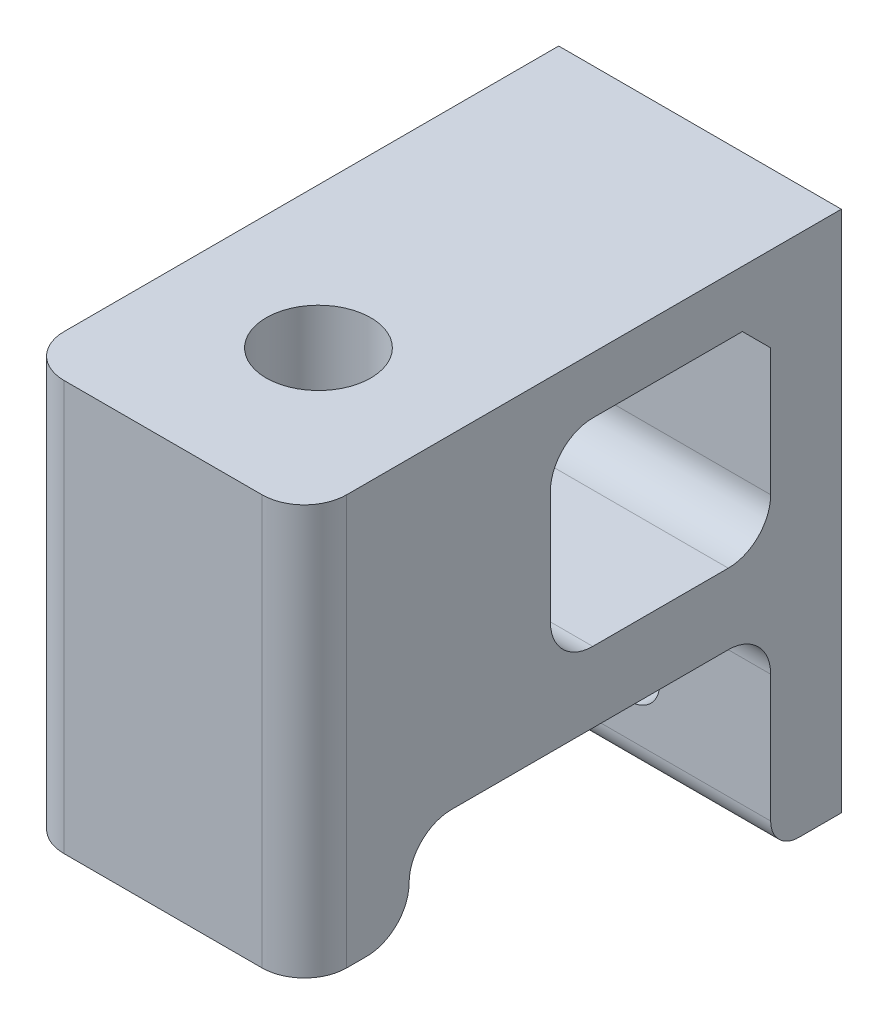
ISO-10303-21;
HEADER;
FILE_DESCRIPTION(('STEP AP214'),'2;1');
FILE_NAME('part.step','',(''),(''),'','','');
FILE_SCHEMA(('AUTOMOTIVE_DESIGN { 1 0 10303 214 1 1 1 1 }'));
ENDSEC;
DATA;
#1=APPLICATION_CONTEXT('core data for automotive mechanical design processes');
#2=APPLICATION_PROTOCOL_DEFINITION('international standard','automotive_design',2000,#1);
#3=PRODUCT_CONTEXT('',#1,'mechanical');
#4=PRODUCT('Part','Part','',(#3));
#5=PRODUCT_RELATED_PRODUCT_CATEGORY('part','',(#4));
#6=PRODUCT_DEFINITION_FORMATION('','',#4);
#7=PRODUCT_DEFINITION_CONTEXT('part definition',#1,'design');
#8=PRODUCT_DEFINITION('design','',#6,#7);
#9=PRODUCT_DEFINITION_SHAPE('','',#8);
#10=(LENGTH_UNIT() NAMED_UNIT(*) SI_UNIT(.MILLI.,.METRE.));
#11=(NAMED_UNIT(*) PLANE_ANGLE_UNIT() SI_UNIT($,.RADIAN.));
#12=(NAMED_UNIT(*) SI_UNIT($,.STERADIAN.) SOLID_ANGLE_UNIT());
#13=UNCERTAINTY_MEASURE_WITH_UNIT(LENGTH_MEASURE(1.E-05),#10,'distance_accuracy_value','');
#14=(GEOMETRIC_REPRESENTATION_CONTEXT(3) GLOBAL_UNCERTAINTY_ASSIGNED_CONTEXT((#13)) GLOBAL_UNIT_ASSIGNED_CONTEXT((#10,
#11,#12)) REPRESENTATION_CONTEXT('',''));
#15=CARTESIAN_POINT('',(0.,0.,0.));
#16=DIRECTION('',(0.,0.,1.));
#17=DIRECTION('',(1.,0.,0.));
#18=AXIS2_PLACEMENT_3D('',#15,#16,#17);
#19=CARTESIAN_POINT('',(20.,0.,38.));
#20=DIRECTION('',(0.,-1.,0.));
#21=DIRECTION('',(0.,0.,-1.));
#22=AXIS2_PLACEMENT_3D('',#19,#20,#21);
#23=PLANE('',#22);
#24=DIRECTION('',(0.,0.,-1.));
#25=VECTOR('',#24,1.);
#26=CARTESIAN_POINT('',(20.,0.,38.));
#27=LINE('',#26,#25);
#28=CARTESIAN_POINT('',(20.,0.,17.5881579312906));
#29=VERTEX_POINT('',#28);
#30=CARTESIAN_POINT('',(20.,0.,7.));
#31=VERTEX_POINT('',#30);
#32=EDGE_CURVE('E212',#29,#31,#27,.T.);
#33=ORIENTED_EDGE('',*,*,#32,.F.);
#34=DIRECTION('',(1.,0.,0.));
#35=VECTOR('',#34,1.);
#36=CARTESIAN_POINT('',(20.,0.,17.5881579312906));
#37=LINE('',#36,#35);
#38=CARTESIAN_POINT('',(0.,0.,17.5881579312906));
#39=VERTEX_POINT('',#38);
#40=EDGE_CURVE('E328',#29,#39,#37,.F.);
#41=ORIENTED_EDGE('',*,*,#40,.T.);
#42=DIRECTION('',(0.,0.,-1.));
#43=VECTOR('',#42,1.);
#44=CARTESIAN_POINT('',(0.,0.,38.));
#45=LINE('',#44,#43);
#46=CARTESIAN_POINT('',(0.,0.,7.));
#47=VERTEX_POINT('',#46);
#48=EDGE_CURVE('E192',#39,#47,#45,.T.);
#49=ORIENTED_EDGE('',*,*,#48,.T.);
#50=DIRECTION('',(1.,0.,0.));
#51=VECTOR('',#50,1.);
#52=CARTESIAN_POINT('',(20.,0.,7.));
#53=LINE('',#52,#51);
#54=EDGE_CURVE('E287',#47,#31,#53,.T.);
#55=ORIENTED_EDGE('',*,*,#54,.T.);
#56=EDGE_LOOP('',(#33,#41,#49,#55));
#57=FACE_BOUND('',#56,.T.);
#58=ADVANCED_FACE('F38',(#57),#23,.T.);
#59=CARTESIAN_POINT('',(0.,-14.,51.2036860593789));
#60=DIRECTION('',(0.,1.,0.));
#61=DIRECTION('',(0.,0.,1.));
#62=AXIS2_PLACEMENT_3D('',#59,#60,#61);
#63=PLANE('',#62);
#64=DIRECTION('',(0.,0.,-1.));
#65=VECTOR('',#64,1.);
#66=CARTESIAN_POINT('',(0.,-14.,51.2036860593789));
#67=LINE('',#66,#65);
#68=CARTESIAN_POINT('',(0.,-14.,17.5881579312906));
#69=VERTEX_POINT('',#68);
#70=CARTESIAN_POINT('',(0.,-14.,8.));
#71=VERTEX_POINT('',#70);
#72=EDGE_CURVE('E371',#69,#71,#67,.T.);
#73=ORIENTED_EDGE('',*,*,#72,.F.);
#74=DIRECTION('',(-1.,0.,0.));
#75=VECTOR('',#74,1.);
#76=CARTESIAN_POINT('',(0.,-14.,17.5881579312906));
#77=LINE('',#76,#75);
#78=CARTESIAN_POINT('',(20.,-14.,17.5881579312906));
#79=VERTEX_POINT('',#78);
#80=EDGE_CURVE('E53',#69,#79,#77,.F.);
#81=ORIENTED_EDGE('',*,*,#80,.T.);
#82=DIRECTION('',(0.,0.,-1.));
#83=VECTOR('',#82,1.);
#84=CARTESIAN_POINT('',(20.,-14.,51.2036860593789));
#85=LINE('',#84,#83);
#86=CARTESIAN_POINT('',(20.,-14.,8.));
#87=VERTEX_POINT('',#86);
#88=EDGE_CURVE('E372',#79,#87,#85,.T.);
#89=ORIENTED_EDGE('',*,*,#88,.T.);
#90=DIRECTION('',(1.,0.,0.));
#91=VECTOR('',#90,1.);
#92=CARTESIAN_POINT('',(0.,-14.,8.));
#93=LINE('',#92,#91);
#94=EDGE_CURVE('E306',#87,#71,#93,.F.);
#95=ORIENTED_EDGE('',*,*,#94,.T.);
#96=EDGE_LOOP('',(#73,#81,#89,#95));
#97=FACE_BOUND('',#96,.T.);
#98=ADVANCED_FACE('F370',(#97),#63,.T.);
#99=CARTESIAN_POINT('',(0.,0.,5.));
#100=DIRECTION('',(0.,0.,1.));
#101=DIRECTION('',(1.,0.,0.));
#102=AXIS2_PLACEMENT_3D('',#99,#100,#101);
#103=PLANE('',#102);
#104=CARTESIAN_POINT('',(10.,-26.5,5.));
#105=DIRECTION('',(0.,0.,1.));
#106=DIRECTION('',(-1.,0.,0.));
#107=AXIS2_PLACEMENT_3D('',#104,#105,#106);
#108=CIRCLE('',#107,2.15);
#109=CARTESIAN_POINT('',(7.85,-26.5,5.));
#110=VERTEX_POINT('',#109);
#111=EDGE_CURVE('E222',#110,#110,#108,.T.);
#112=ORIENTED_EDGE('',*,*,#111,.F.);
#113=EDGE_LOOP('',(#112));
#114=FACE_BOUND('',#113,.T.);
#115=DIRECTION('',(0.,1.,0.));
#116=VECTOR('',#115,1.);
#117=CARTESIAN_POINT('',(20.,0.,5.));
#118=LINE('',#117,#116);
#119=CARTESIAN_POINT('',(20.,-31.,5.));
#120=VERTEX_POINT('',#119);
#121=CARTESIAN_POINT('',(20.,-22.,5.));
#122=VERTEX_POINT('',#121);
#123=EDGE_CURVE('E237',#120,#122,#118,.T.);
#124=ORIENTED_EDGE('',*,*,#123,.T.);
#125=DIRECTION('',(1.,0.,0.));
#126=VECTOR('',#125,1.);
#127=CARTESIAN_POINT('',(0.,-22.,5.));
#128=LINE('',#127,#126);
#129=CARTESIAN_POINT('',(0.,-22.,5.));
#130=VERTEX_POINT('',#129);
#131=EDGE_CURVE('E301',#122,#130,#128,.F.);
#132=ORIENTED_EDGE('',*,*,#131,.T.);
#133=DIRECTION('',(0.,-1.,0.));
#134=VECTOR('',#133,1.);
#135=CARTESIAN_POINT('',(0.,0.,5.));
#136=LINE('',#135,#134);
#137=CARTESIAN_POINT('',(0.,-31.,5.));
#138=VERTEX_POINT('',#137);
#139=EDGE_CURVE('E236',#130,#138,#136,.T.);
#140=ORIENTED_EDGE('',*,*,#139,.T.);
#141=DIRECTION('',(1.,0.,0.));
#142=VECTOR('',#141,1.);
#143=CARTESIAN_POINT('',(20.,-31.,5.));
#144=LINE('',#143,#142);
#145=EDGE_CURVE('E263',#138,#120,#144,.T.);
#146=ORIENTED_EDGE('',*,*,#145,.T.);
#147=EDGE_LOOP('',(#124,#132,#140,#146));
#148=FACE_BOUND('',#147,.T.);
#149=ADVANCED_FACE('F408',(#114,#148),#103,.T.);
#150=CARTESIAN_POINT('',(0.,-2.00000000000002,5.));
#151=VERTEX_POINT('',#150);
#152=CARTESIAN_POINT('',(0.,-11.,5.));
#153=VERTEX_POINT('',#152);
#154=EDGE_CURVE('E232',#151,#153,#136,.T.);
#155=ORIENTED_EDGE('',*,*,#154,.T.);
#156=DIRECTION('',(1.,0.,0.));
#157=VECTOR('',#156,1.);
#158=CARTESIAN_POINT('',(20.,-11.,5.));
#159=LINE('',#158,#157);
#160=CARTESIAN_POINT('',(20.,-11.,5.));
#161=VERTEX_POINT('',#160);
#162=EDGE_CURVE('E303',#153,#161,#159,.T.);
#163=ORIENTED_EDGE('',*,*,#162,.T.);
#164=CARTESIAN_POINT('',(20.,-2.00000000000002,5.));
#165=VERTEX_POINT('',#164);
#166=EDGE_CURVE('E235',#161,#165,#118,.T.);
#167=ORIENTED_EDGE('',*,*,#166,.T.);
#168=DIRECTION('',(-1.,0.,0.));
#169=VECTOR('',#168,1.);
#170=CARTESIAN_POINT('',(0.,-2.00000000000002,5.));
#171=LINE('',#170,#169);
#172=EDGE_CURVE('E284',#165,#151,#171,.T.);
#173=ORIENTED_EDGE('',*,*,#172,.T.);
#174=EDGE_LOOP('',(#155,#163,#167,#173));
#175=FACE_BOUND('',#174,.T.);
#176=CARTESIAN_POINT('',(10.,-6.5,5.));
#177=DIRECTION('',(0.,0.,1.));
#178=DIRECTION('',(1.,0.,0.));
#179=AXIS2_PLACEMENT_3D('',#176,#177,#178);
#180=CIRCLE('',#179,2.15);
#181=CARTESIAN_POINT('',(12.15,-6.5,5.));
#182=VERTEX_POINT('',#181);
#183=EDGE_CURVE('E203',#182,#182,#180,.T.);
#184=ORIENTED_EDGE('',*,*,#183,.F.);
#185=EDGE_LOOP('',(#184));
#186=FACE_BOUND('',#185,.T.);
#187=ADVANCED_FACE('F363',(#175,#186),#103,.T.);
#188=CARTESIAN_POINT('',(0.,0.,0.));
#189=DIRECTION('',(0.,0.,1.));
#190=DIRECTION('',(1.,0.,0.));
#191=AXIS2_PLACEMENT_3D('',#188,#189,#190);
#192=PLANE('',#191);
#193=DIRECTION('',(0.,-1.,0.));
#194=VECTOR('',#193,1.);
#195=CARTESIAN_POINT('',(0.,0.,0.));
#196=LINE('',#195,#194);
#197=CARTESIAN_POINT('',(0.,4.,0.));
#198=VERTEX_POINT('',#197);
#199=CARTESIAN_POINT('',(0.,-33.,0.));
#200=VERTEX_POINT('',#199);
#201=EDGE_CURVE('E185',#198,#200,#196,.T.);
#202=ORIENTED_EDGE('',*,*,#201,.F.);
#203=DIRECTION('',(1.,0.,0.));
#204=VECTOR('',#203,1.);
#205=CARTESIAN_POINT('',(20.,4.,0.));
#206=LINE('',#205,#204);
#207=CARTESIAN_POINT('',(20.,4.,0.));
#208=VERTEX_POINT('',#207);
#209=EDGE_CURVE('E200',#198,#208,#206,.T.);
#210=ORIENTED_EDGE('',*,*,#209,.T.);
#211=DIRECTION('',(0.,1.,0.));
#212=VECTOR('',#211,1.);
#213=CARTESIAN_POINT('',(20.,0.,0.));
#214=LINE('',#213,#212);
#215=CARTESIAN_POINT('',(20.,-33.,0.));
#216=VERTEX_POINT('',#215);
#217=EDGE_CURVE('E242',#216,#208,#214,.T.);
#218=ORIENTED_EDGE('',*,*,#217,.F.);
#219=DIRECTION('',(1.,0.,0.));
#220=VECTOR('',#219,1.);
#221=CARTESIAN_POINT('',(0.,-33.,0.));
#222=LINE('',#221,#220);
#223=EDGE_CURVE('E202',#200,#216,#222,.T.);
#224=ORIENTED_EDGE('',*,*,#223,.F.);
#225=EDGE_LOOP('',(#202,#210,#218,#224));
#226=FACE_BOUND('',#225,.T.);
#227=CARTESIAN_POINT('',(10.,-6.5,0.));
#228=DIRECTION('',(0.,0.,1.));
#229=DIRECTION('',(1.,0.,0.));
#230=AXIS2_PLACEMENT_3D('',#227,#228,#229);
#231=CIRCLE('',#230,2.15);
#232=CARTESIAN_POINT('',(12.15,-6.5,0.));
#233=VERTEX_POINT('',#232);
#234=EDGE_CURVE('E225',#233,#233,#231,.T.);
#235=ORIENTED_EDGE('',*,*,#234,.T.);
#236=EDGE_LOOP('',(#235));
#237=FACE_BOUND('',#236,.T.);
#238=CARTESIAN_POINT('',(10.,-26.5,0.));
#239=DIRECTION('',(0.,0.,1.));
#240=DIRECTION('',(-1.,0.,0.));
#241=AXIS2_PLACEMENT_3D('',#238,#239,#240);
#242=CIRCLE('',#241,2.15);
#243=CARTESIAN_POINT('',(7.85,-26.5,0.));
#244=VERTEX_POINT('',#243);
#245=EDGE_CURVE('E218',#244,#244,#242,.T.);
#246=ORIENTED_EDGE('',*,*,#245,.T.);
#247=EDGE_LOOP('',(#246));
#248=FACE_BOUND('',#247,.T.);
#249=ADVANCED_FACE('F197',(#226,#237,#248),#192,.F.);
#250=CARTESIAN_POINT('',(0.,0.,5.));
#251=DIRECTION('',(1.,0.,0.));
#252=DIRECTION('',(0.,0.,-1.));
#253=AXIS2_PLACEMENT_3D('',#250,#251,#252);
#254=PLANE('',#253);
#255=ORIENTED_EDGE('',*,*,#48,.F.);
#256=CARTESIAN_POINT('',(0.,-3.,17.5881579312906));
#257=DIRECTION('',(1.,0.,0.));
#258=DIRECTION('',(0.,0.,-1.));
#259=AXIS2_PLACEMENT_3D('',#256,#257,#258);
#260=CIRCLE('',#259,3.);
#261=CARTESIAN_POINT('',(0.,-3.,20.5881579312906));
#262=VERTEX_POINT('',#261);
#263=EDGE_CURVE('E333',#39,#262,#260,.T.);
#264=ORIENTED_EDGE('',*,*,#263,.T.);
#265=DIRECTION('',(0.,-1.,0.));
#266=VECTOR('',#265,1.);
#267=CARTESIAN_POINT('',(0.,22.3606797749979,20.5881579312906));
#268=LINE('',#267,#266);
#269=CARTESIAN_POINT('',(0.,-11.,20.5881579312906));
#270=VERTEX_POINT('',#269);
#271=EDGE_CURVE('E337',#262,#270,#268,.T.);
#272=ORIENTED_EDGE('',*,*,#271,.T.);
#273=CARTESIAN_POINT('',(0.,-11.,17.5881579312906));
#274=DIRECTION('',(1.,0.,0.));
#275=DIRECTION('',(0.,0.,-1.));
#276=AXIS2_PLACEMENT_3D('',#273,#274,#275);
#277=CIRCLE('',#276,3.);
#278=EDGE_CURVE('E46',#270,#69,#277,.T.);
#279=ORIENTED_EDGE('',*,*,#278,.T.);
#280=ORIENTED_EDGE('',*,*,#72,.T.);
#281=CARTESIAN_POINT('',(0.,-11.,8.));
#282=DIRECTION('',(1.,0.,0.));
#283=DIRECTION('',(0.,0.,-1.));
#284=AXIS2_PLACEMENT_3D('',#281,#282,#283);
#285=CIRCLE('',#284,3.);
#286=EDGE_CURVE('E320',#71,#153,#285,.T.);
#287=ORIENTED_EDGE('',*,*,#286,.T.);
#288=ORIENTED_EDGE('',*,*,#154,.F.);
#289=DIRECTION('',(0.,-0.707106781186551,-0.707106781186544));
#290=VECTOR('',#289,1.);
#291=CARTESIAN_POINT('',(0.,-0.999999999999998,6.00000000000001));
#292=LINE('',#291,#290);
#293=EDGE_CURVE('E290',#151,#47,#292,.F.);
#294=ORIENTED_EDGE('',*,*,#293,.T.);
#295=EDGE_LOOP('',(#255,#264,#272,#279,#280,#287,#288,#294));
#296=FACE_BOUND('',#295,.T.);
#297=ORIENTED_EDGE('',*,*,#139,.F.);
#298=CARTESIAN_POINT('',(0.,-22.,8.));
#299=DIRECTION('',(1.,0.,0.));
#300=DIRECTION('',(0.,0.,-1.));
#301=AXIS2_PLACEMENT_3D('',#298,#299,#300);
#302=CIRCLE('',#301,3.);
#303=CARTESIAN_POINT('',(0.,-19.,8.));
#304=VERTEX_POINT('',#303);
#305=EDGE_CURVE('E311',#130,#304,#302,.T.);
#306=ORIENTED_EDGE('',*,*,#305,.T.);
#307=DIRECTION('',(0.,0.,-1.));
#308=VECTOR('',#307,1.);
#309=CARTESIAN_POINT('',(0.,-19.,51.2036860593789));
#310=LINE('',#309,#308);
#311=CARTESIAN_POINT('',(0.,-19.,27.5881579312906));
#312=VERTEX_POINT('',#311);
#313=EDGE_CURVE('E379',#312,#304,#310,.T.);
#314=ORIENTED_EDGE('',*,*,#313,.F.);
#315=CARTESIAN_POINT('',(0.,-22.,27.5881579312906));
#316=DIRECTION('',(1.,0.,0.));
#317=DIRECTION('',(0.,0.,-1.));
#318=AXIS2_PLACEMENT_3D('',#315,#316,#317);
#319=CIRCLE('',#318,3.);
#320=CARTESIAN_POINT('',(0.,-22.,30.5881579312906));
#321=VERTEX_POINT('',#320);
#322=EDGE_CURVE('E315',#312,#321,#319,.T.);
#323=ORIENTED_EDGE('',*,*,#322,.T.);
#324=CARTESIAN_POINT('',(0.,-22.,33.5881579312906));
#325=DIRECTION('',(1.,0.,0.));
#326=DIRECTION('',(0.,0.,-1.));
#327=AXIS2_PLACEMENT_3D('',#324,#325,#326);
#328=CIRCLE('',#327,3.);
#329=CARTESIAN_POINT('',(0.,-25.,33.5881579312906));
#330=VERTEX_POINT('',#329);
#331=EDGE_CURVE('E282',#321,#330,#328,.F.);
#332=ORIENTED_EDGE('',*,*,#331,.T.);
#333=DIRECTION('',(0.,0.,-1.));
#334=VECTOR('',#333,1.);
#335=CARTESIAN_POINT('',(0.,-25.,38.));
#336=LINE('',#335,#334);
#337=CARTESIAN_POINT('',(0.,-25.,35.));
#338=VERTEX_POINT('',#337);
#339=EDGE_CURVE('E376',#338,#330,#336,.T.);
#340=ORIENTED_EDGE('',*,*,#339,.F.);
#341=DIRECTION('',(0.,1.,0.));
#342=VECTOR('',#341,1.);
#343=CARTESIAN_POINT('',(0.,4.,35.));
#344=LINE('',#343,#342);
#345=CARTESIAN_POINT('',(0.,4.,35.));
#346=VERTEX_POINT('',#345);
#347=EDGE_CURVE('E188',#338,#346,#344,.T.);
#348=ORIENTED_EDGE('',*,*,#347,.T.);
#349=DIRECTION('',(0.,0.,-1.));
#350=VECTOR('',#349,1.);
#351=CARTESIAN_POINT('',(0.,4.,38.));
#352=LINE('',#351,#350);
#353=EDGE_CURVE('E180',#346,#198,#352,.T.);
#354=ORIENTED_EDGE('',*,*,#353,.T.);
#355=ORIENTED_EDGE('',*,*,#201,.T.);
#356=DIRECTION('',(0.,0.,-1.));
#357=VECTOR('',#356,1.);
#358=CARTESIAN_POINT('',(0.,-33.,5.));
#359=LINE('',#358,#357);
#360=CARTESIAN_POINT('',(0.,-33.,3.));
#361=VERTEX_POINT('',#360);
#362=EDGE_CURVE('E245',#361,#200,#359,.T.);
#363=ORIENTED_EDGE('',*,*,#362,.F.);
#364=CARTESIAN_POINT('',(0.,-31.,3.));
#365=DIRECTION('',(1.,0.,0.));
#366=DIRECTION('',(0.,0.,-1.));
#367=AXIS2_PLACEMENT_3D('',#364,#365,#366);
#368=CIRCLE('',#367,2.);
#369=EDGE_CURVE('E270',#361,#138,#368,.F.);
#370=ORIENTED_EDGE('',*,*,#369,.T.);
#371=EDGE_LOOP('',(#297,#306,#314,#323,#332,#340,#348,#354,#355,#363,#370));
#372=FACE_BOUND('',#371,.T.);
#373=ADVANCED_FACE('F183',(#296,#372),#254,.F.);
#374=CARTESIAN_POINT('',(0.,-33.,5.));
#375=DIRECTION('',(0.,1.,0.));
#376=DIRECTION('',(0.,0.,1.));
#377=AXIS2_PLACEMENT_3D('',#374,#375,#376);
#378=PLANE('',#377);
#379=DIRECTION('',(0.,0.,-1.));
#380=VECTOR('',#379,1.);
#381=CARTESIAN_POINT('',(20.,-33.,5.));
#382=LINE('',#381,#380);
#383=CARTESIAN_POINT('',(20.,-33.,3.));
#384=VERTEX_POINT('',#383);
#385=EDGE_CURVE('E239',#384,#216,#382,.T.);
#386=ORIENTED_EDGE('',*,*,#385,.F.);
#387=DIRECTION('',(1.,0.,0.));
#388=VECTOR('',#387,1.);
#389=CARTESIAN_POINT('',(0.,-33.,3.));
#390=LINE('',#389,#388);
#391=EDGE_CURVE('E268',#384,#361,#390,.F.);
#392=ORIENTED_EDGE('',*,*,#391,.T.);
#393=ORIENTED_EDGE('',*,*,#362,.T.);
#394=ORIENTED_EDGE('',*,*,#223,.T.);
#395=EDGE_LOOP('',(#386,#392,#393,#394));
#396=FACE_BOUND('',#395,.T.);
#397=ADVANCED_FACE('F402',(#396),#378,.F.);
#398=CARTESIAN_POINT('',(20.,0.,5.));
#399=DIRECTION('',(-1.,0.,0.));
#400=DIRECTION('',(0.,0.,1.));
#401=AXIS2_PLACEMENT_3D('',#398,#399,#400);
#402=PLANE('',#401);
#403=DIRECTION('',(0.,-1.,0.));
#404=VECTOR('',#403,1.);
#405=CARTESIAN_POINT('',(20.,22.3606797749979,20.5881579312906));
#406=LINE('',#405,#404);
#407=CARTESIAN_POINT('',(20.,-3.,20.5881579312906));
#408=VERTEX_POINT('',#407);
#409=CARTESIAN_POINT('',(20.,-11.,20.5881579312906));
#410=VERTEX_POINT('',#409);
#411=EDGE_CURVE('E346',#408,#410,#406,.T.);
#412=ORIENTED_EDGE('',*,*,#411,.F.);
#413=CARTESIAN_POINT('',(20.,-3.,17.5881579312906));
#414=DIRECTION('',(-1.,0.,0.));
#415=DIRECTION('',(0.,0.,1.));
#416=AXIS2_PLACEMENT_3D('',#413,#414,#415);
#417=CIRCLE('',#416,3.);
#418=EDGE_CURVE('E331',#408,#29,#417,.T.);
#419=ORIENTED_EDGE('',*,*,#418,.T.);
#420=ORIENTED_EDGE('',*,*,#32,.T.);
#421=DIRECTION('',(0.,0.707106781186551,0.707106781186544));
#422=VECTOR('',#421,1.);
#423=CARTESIAN_POINT('',(20.,-0.999999999999998,6.00000000000001));
#424=LINE('',#423,#422);
#425=EDGE_CURVE('E293',#31,#165,#424,.F.);
#426=ORIENTED_EDGE('',*,*,#425,.T.);
#427=ORIENTED_EDGE('',*,*,#166,.F.);
#428=CARTESIAN_POINT('',(20.,-11.,8.));
#429=DIRECTION('',(-1.,0.,0.));
#430=DIRECTION('',(0.,0.,1.));
#431=AXIS2_PLACEMENT_3D('',#428,#429,#430);
#432=CIRCLE('',#431,3.);
#433=EDGE_CURVE('E317',#161,#87,#432,.T.);
#434=ORIENTED_EDGE('',*,*,#433,.T.);
#435=ORIENTED_EDGE('',*,*,#88,.F.);
#436=CARTESIAN_POINT('',(20.,-11.,17.5881579312906));
#437=DIRECTION('',(-1.,0.,0.));
#438=DIRECTION('',(0.,0.,1.));
#439=AXIS2_PLACEMENT_3D('',#436,#437,#438);
#440=CIRCLE('',#439,3.);
#441=EDGE_CURVE('E11',#79,#410,#440,.T.);
#442=ORIENTED_EDGE('',*,*,#441,.T.);
#443=EDGE_LOOP('',(#412,#419,#420,#426,#427,#434,#435,#442));
#444=FACE_BOUND('',#443,.T.);
#445=CARTESIAN_POINT('',(20.,-22.,33.5881579312906));
#446=DIRECTION('',(-1.,0.,0.));
#447=DIRECTION('',(0.,0.,1.));
#448=AXIS2_PLACEMENT_3D('',#445,#446,#447);
#449=CIRCLE('',#448,3.);
#450=CARTESIAN_POINT('',(20.,-25.,33.5881579312906));
#451=VERTEX_POINT('',#450);
#452=CARTESIAN_POINT('',(20.,-22.,30.5881579312906));
#453=VERTEX_POINT('',#452);
#454=EDGE_CURVE('E276',#451,#453,#449,.F.);
#455=ORIENTED_EDGE('',*,*,#454,.T.);
#456=CARTESIAN_POINT('',(20.,-22.,27.5881579312906));
#457=DIRECTION('',(-1.,0.,0.));
#458=DIRECTION('',(0.,0.,1.));
#459=AXIS2_PLACEMENT_3D('',#456,#457,#458);
#460=CIRCLE('',#459,3.);
#461=CARTESIAN_POINT('',(20.,-19.,27.5881579312906));
#462=VERTEX_POINT('',#461);
#463=EDGE_CURVE('E313',#453,#462,#460,.T.);
#464=ORIENTED_EDGE('',*,*,#463,.T.);
#465=DIRECTION('',(0.,0.,-1.));
#466=VECTOR('',#465,1.);
#467=CARTESIAN_POINT('',(20.,-19.,51.2036860593789));
#468=LINE('',#467,#466);
#469=CARTESIAN_POINT('',(20.,-19.,8.));
#470=VERTEX_POINT('',#469);
#471=EDGE_CURVE('E374',#462,#470,#468,.T.);
#472=ORIENTED_EDGE('',*,*,#471,.T.);
#473=CARTESIAN_POINT('',(20.,-22.,8.));
#474=DIRECTION('',(-1.,0.,0.));
#475=DIRECTION('',(0.,0.,1.));
#476=AXIS2_PLACEMENT_3D('',#473,#474,#475);
#477=CIRCLE('',#476,3.);
#478=EDGE_CURVE('E309',#470,#122,#477,.T.);
#479=ORIENTED_EDGE('',*,*,#478,.T.);
#480=ORIENTED_EDGE('',*,*,#123,.F.);
#481=CARTESIAN_POINT('',(20.,-31.,3.));
#482=DIRECTION('',(-1.,0.,0.));
#483=DIRECTION('',(0.,0.,1.));
#484=AXIS2_PLACEMENT_3D('',#481,#482,#483);
#485=CIRCLE('',#484,2.);
#486=EDGE_CURVE('E266',#120,#384,#485,.F.);
#487=ORIENTED_EDGE('',*,*,#486,.T.);
#488=ORIENTED_EDGE('',*,*,#385,.T.);
#489=ORIENTED_EDGE('',*,*,#217,.T.);
#490=DIRECTION('',(0.,0.,-1.));
#491=VECTOR('',#490,1.);
#492=CARTESIAN_POINT('',(20.,4.,38.));
#493=LINE('',#492,#491);
#494=CARTESIAN_POINT('',(20.,4.,35.));
#495=VERTEX_POINT('',#494);
#496=EDGE_CURVE('E191',#495,#208,#493,.T.);
#497=ORIENTED_EDGE('',*,*,#496,.F.);
#498=DIRECTION('',(0.,-1.,0.));
#499=VECTOR('',#498,1.);
#500=CARTESIAN_POINT('',(20.,-25.,35.));
#501=LINE('',#500,#499);
#502=CARTESIAN_POINT('',(20.,-25.,35.));
#503=VERTEX_POINT('',#502);
#504=EDGE_CURVE('E260',#495,#503,#501,.T.);
#505=ORIENTED_EDGE('',*,*,#504,.T.);
#506=DIRECTION('',(0.,0.,1.));
#507=VECTOR('',#506,1.);
#508=CARTESIAN_POINT('',(20.,-25.,38.));
#509=LINE('',#508,#507);
#510=EDGE_CURVE('E215',#451,#503,#509,.T.);
#511=ORIENTED_EDGE('',*,*,#510,.F.);
#512=EDGE_LOOP('',(#455,#464,#472,#479,#480,#487,#488,#489,#497,#505,#511));
#513=FACE_BOUND('',#512,.T.);
#514=ADVANCED_FACE('F352',(#444,#513),#402,.F.);
#515=CARTESIAN_POINT('',(10.,-6.5,5.));
#516=DIRECTION('',(0.,0.,-1.));
#517=DIRECTION('',(-1.,0.,0.));
#518=AXIS2_PLACEMENT_3D('',#515,#516,#517);
#519=CYLINDRICAL_SURFACE('',#518,2.15);
#520=ORIENTED_EDGE('',*,*,#183,.T.);
#521=EDGE_LOOP('',(#520));
#522=FACE_BOUND('',#521,.T.);
#523=ORIENTED_EDGE('',*,*,#234,.F.);
#524=EDGE_LOOP('',(#523));
#525=FACE_BOUND('',#524,.T.);
#526=ADVANCED_FACE('F452',(#522,#525),#519,.F.);
#527=CARTESIAN_POINT('',(10.,-26.5,5.));
#528=DIRECTION('',(0.,0.,-1.));
#529=DIRECTION('',(-1.,0.,0.));
#530=AXIS2_PLACEMENT_3D('',#527,#528,#529);
#531=CYLINDRICAL_SURFACE('',#530,2.15);
#532=ORIENTED_EDGE('',*,*,#111,.T.);
#533=EDGE_LOOP('',(#532));
#534=FACE_BOUND('',#533,.T.);
#535=ORIENTED_EDGE('',*,*,#245,.F.);
#536=EDGE_LOOP('',(#535));
#537=FACE_BOUND('',#536,.T.);
#538=ADVANCED_FACE('F440',(#534,#537),#531,.F.);
#539=CARTESIAN_POINT('',(20.,4.,38.));
#540=DIRECTION('',(0.,1.,0.));
#541=DIRECTION('',(0.,0.,1.));
#542=AXIS2_PLACEMENT_3D('',#539,#540,#541);
#543=PLANE('',#542);
#544=CARTESIAN_POINT('',(10.,4.,27.));
#545=DIRECTION('',(0.,1.,0.));
#546=DIRECTION('',(0.,0.,1.));
#547=AXIS2_PLACEMENT_3D('',#544,#545,#546);
#548=CIRCLE('',#547,3.7);
#549=CARTESIAN_POINT('',(10.,4.,30.7));
#550=VERTEX_POINT('',#549);
#551=EDGE_CURVE('E696',#550,#550,#548,.T.);
#552=ORIENTED_EDGE('',*,*,#551,.F.);
#553=EDGE_LOOP('',(#552));
#554=FACE_BOUND('',#553,.T.);
#555=ORIENTED_EDGE('',*,*,#353,.F.);
#556=CARTESIAN_POINT('',(3.,4.,35.));
#557=DIRECTION('',(0.,1.,0.));
#558=DIRECTION('',(0.,0.,1.));
#559=AXIS2_PLACEMENT_3D('',#556,#557,#558);
#560=CIRCLE('',#559,3.);
#561=CARTESIAN_POINT('',(3.,4.,38.));
#562=VERTEX_POINT('',#561);
#563=EDGE_CURVE('E250',#346,#562,#560,.T.);
#564=ORIENTED_EDGE('',*,*,#563,.T.);
#565=DIRECTION('',(1.,0.,0.));
#566=VECTOR('',#565,1.);
#567=CARTESIAN_POINT('',(20.,4.,38.));
#568=LINE('',#567,#566);
#569=CARTESIAN_POINT('',(17.,4.,38.));
#570=VERTEX_POINT('',#569);
#571=EDGE_CURVE('E208',#562,#570,#568,.T.);
#572=ORIENTED_EDGE('',*,*,#571,.T.);
#573=CARTESIAN_POINT('',(17.,4.,35.));
#574=DIRECTION('',(0.,1.,0.));
#575=DIRECTION('',(0.,0.,1.));
#576=AXIS2_PLACEMENT_3D('',#573,#574,#575);
#577=CIRCLE('',#576,3.);
#578=EDGE_CURVE('E248',#570,#495,#577,.T.);
#579=ORIENTED_EDGE('',*,*,#578,.T.);
#580=ORIENTED_EDGE('',*,*,#496,.T.);
#581=ORIENTED_EDGE('',*,*,#209,.F.);
#582=EDGE_LOOP('',(#555,#564,#572,#579,#580,#581));
#583=FACE_BOUND('',#582,.T.);
#584=ADVANCED_FACE('F205',(#554,#583),#543,.T.);
#585=CARTESIAN_POINT('',(0.,0.,38.));
#586=DIRECTION('',(0.,0.,1.));
#587=DIRECTION('',(1.,0.,0.));
#588=AXIS2_PLACEMENT_3D('',#585,#586,#587);
#589=PLANE('',#588);
#590=ORIENTED_EDGE('',*,*,#571,.F.);
#591=DIRECTION('',(0.,1.,0.));
#592=VECTOR('',#591,1.);
#593=CARTESIAN_POINT('',(3.,-25.,38.));
#594=LINE('',#593,#592);
#595=CARTESIAN_POINT('',(3.,-25.,38.));
#596=VERTEX_POINT('',#595);
#597=EDGE_CURVE('E254',#562,#596,#594,.F.);
#598=ORIENTED_EDGE('',*,*,#597,.T.);
#599=DIRECTION('',(-1.,0.,0.));
#600=VECTOR('',#599,1.);
#601=CARTESIAN_POINT('',(0.,-25.,38.));
#602=LINE('',#601,#600);
#603=CARTESIAN_POINT('',(17.,-25.,38.));
#604=VERTEX_POINT('',#603);
#605=EDGE_CURVE('E209',#604,#596,#602,.T.);
#606=ORIENTED_EDGE('',*,*,#605,.F.);
#607=DIRECTION('',(0.,-1.,0.));
#608=VECTOR('',#607,1.);
#609=CARTESIAN_POINT('',(17.,4.,38.));
#610=LINE('',#609,#608);
#611=EDGE_CURVE('E252',#604,#570,#610,.F.);
#612=ORIENTED_EDGE('',*,*,#611,.T.);
#613=EDGE_LOOP('',(#590,#598,#606,#612));
#614=FACE_BOUND('',#613,.T.);
#615=ADVANCED_FACE('F432',(#614),#589,.T.);
#616=CARTESIAN_POINT('',(0.,-25.,0.));
#617=DIRECTION('',(0.,-1.,0.));
#618=DIRECTION('',(0.,0.,-1.));
#619=AXIS2_PLACEMENT_3D('',#616,#617,#618);
#620=PLANE('',#619);
#621=ORIENTED_EDGE('',*,*,#339,.T.);
#622=DIRECTION('',(1.,0.,0.));
#623=VECTOR('',#622,1.);
#624=CARTESIAN_POINT('',(20.,-25.,33.5881579312906));
#625=LINE('',#624,#623);
#626=EDGE_CURVE('E273',#330,#451,#625,.T.);
#627=ORIENTED_EDGE('',*,*,#626,.T.);
#628=ORIENTED_EDGE('',*,*,#510,.T.);
#629=CARTESIAN_POINT('',(17.,-25.,35.));
#630=DIRECTION('',(0.,-1.,0.));
#631=DIRECTION('',(0.,0.,-1.));
#632=AXIS2_PLACEMENT_3D('',#629,#630,#631);
#633=CIRCLE('',#632,3.);
#634=EDGE_CURVE('E256',#503,#604,#633,.T.);
#635=ORIENTED_EDGE('',*,*,#634,.T.);
#636=ORIENTED_EDGE('',*,*,#605,.T.);
#637=CARTESIAN_POINT('',(3.,-25.,35.));
#638=DIRECTION('',(0.,-1.,0.));
#639=DIRECTION('',(0.,0.,-1.));
#640=AXIS2_PLACEMENT_3D('',#637,#638,#639);
#641=CIRCLE('',#640,3.);
#642=EDGE_CURVE('E258',#596,#338,#641,.T.);
#643=ORIENTED_EDGE('',*,*,#642,.T.);
#644=EDGE_LOOP('',(#621,#627,#628,#635,#636,#643));
#645=FACE_BOUND('',#644,.T.);
#646=ADVANCED_FACE('F390',(#645),#620,.T.);
#647=CARTESIAN_POINT('',(3.,0.,35.));
#648=DIRECTION('',(0.,-1.,0.));
#649=DIRECTION('',(0.,0.,-1.));
#650=AXIS2_PLACEMENT_3D('',#647,#648,#649);
#651=CYLINDRICAL_SURFACE('',#650,3.);
#652=ORIENTED_EDGE('',*,*,#642,.F.);
#653=ORIENTED_EDGE('',*,*,#597,.F.);
#654=ORIENTED_EDGE('',*,*,#563,.F.);
#655=ORIENTED_EDGE('',*,*,#347,.F.);
#656=EDGE_LOOP('',(#652,#653,#654,#655));
#657=FACE_BOUND('',#656,.T.);
#658=ADVANCED_FACE('F429',(#657),#651,.T.);
#659=CARTESIAN_POINT('',(17.,0.,35.));
#660=DIRECTION('',(0.,1.,0.));
#661=DIRECTION('',(0.,0.,1.));
#662=AXIS2_PLACEMENT_3D('',#659,#660,#661);
#663=CYLINDRICAL_SURFACE('',#662,3.);
#664=ORIENTED_EDGE('',*,*,#578,.F.);
#665=ORIENTED_EDGE('',*,*,#611,.F.);
#666=ORIENTED_EDGE('',*,*,#634,.F.);
#667=ORIENTED_EDGE('',*,*,#504,.F.);
#668=EDGE_LOOP('',(#664,#665,#666,#667));
#669=FACE_BOUND('',#668,.T.);
#670=ADVANCED_FACE('F397',(#669),#663,.T.);
#671=CARTESIAN_POINT('',(0.,-31.,3.));
#672=DIRECTION('',(-1.,0.,0.));
#673=DIRECTION('',(0.,0.,1.));
#674=AXIS2_PLACEMENT_3D('',#671,#672,#673);
#675=CYLINDRICAL_SURFACE('',#674,2.);
#676=ORIENTED_EDGE('',*,*,#369,.F.);
#677=ORIENTED_EDGE('',*,*,#391,.F.);
#678=ORIENTED_EDGE('',*,*,#486,.F.);
#679=ORIENTED_EDGE('',*,*,#145,.F.);
#680=EDGE_LOOP('',(#676,#677,#678,#679));
#681=FACE_BOUND('',#680,.T.);
#682=ADVANCED_FACE('F406',(#681),#675,.T.);
#683=CARTESIAN_POINT('',(0.,-22.,33.5881579312906));
#684=DIRECTION('',(-1.,0.,0.));
#685=DIRECTION('',(0.,0.,1.));
#686=AXIS2_PLACEMENT_3D('',#683,#684,#685);
#687=CYLINDRICAL_SURFACE('',#686,3.);
#688=ORIENTED_EDGE('',*,*,#331,.F.);
#689=DIRECTION('',(1.,0.,0.));
#690=VECTOR('',#689,1.);
#691=CARTESIAN_POINT('',(0.,-22.,30.5881579312906));
#692=LINE('',#691,#690);
#693=EDGE_CURVE('E279',#453,#321,#692,.F.);
#694=ORIENTED_EDGE('',*,*,#693,.F.);
#695=ORIENTED_EDGE('',*,*,#454,.F.);
#696=ORIENTED_EDGE('',*,*,#626,.F.);
#697=EDGE_LOOP('',(#688,#694,#695,#696));
#698=FACE_BOUND('',#697,.T.);
#699=ADVANCED_FACE('F425',(#698),#687,.T.);
#700=CARTESIAN_POINT('',(0.,-2.00000000000002,5.));
#701=DIRECTION('',(0.,-0.707106781186544,0.707106781186551));
#702=DIRECTION('',(1.,0.,0.));
#703=AXIS2_PLACEMENT_3D('',#700,#701,#702);
#704=PLANE('',#703);
#705=ORIENTED_EDGE('',*,*,#425,.F.);
#706=ORIENTED_EDGE('',*,*,#54,.F.);
#707=ORIENTED_EDGE('',*,*,#293,.F.);
#708=ORIENTED_EDGE('',*,*,#172,.F.);
#709=EDGE_LOOP('',(#705,#706,#707,#708));
#710=FACE_BOUND('',#709,.T.);
#711=ADVANCED_FACE('F359',(#710),#704,.T.);
#712=CARTESIAN_POINT('',(0.,-19.,51.2036860593789));
#713=DIRECTION('',(0.,1.,0.));
#714=DIRECTION('',(0.,0.,1.));
#715=AXIS2_PLACEMENT_3D('',#712,#713,#714);
#716=PLANE('',#715);
#717=ORIENTED_EDGE('',*,*,#313,.T.);
#718=DIRECTION('',(1.,0.,0.));
#719=VECTOR('',#718,1.);
#720=CARTESIAN_POINT('',(0.,-19.,8.));
#721=LINE('',#720,#719);
#722=EDGE_CURVE('E298',#304,#470,#721,.T.);
#723=ORIENTED_EDGE('',*,*,#722,.T.);
#724=ORIENTED_EDGE('',*,*,#471,.F.);
#725=DIRECTION('',(1.,0.,0.));
#726=VECTOR('',#725,1.);
#727=CARTESIAN_POINT('',(0.,-19.,27.5881579312906));
#728=LINE('',#727,#726);
#729=EDGE_CURVE('E296',#462,#312,#728,.F.);
#730=ORIENTED_EDGE('',*,*,#729,.T.);
#731=EDGE_LOOP('',(#717,#723,#724,#730));
#732=FACE_BOUND('',#731,.T.);
#733=ADVANCED_FACE('F416',(#732),#716,.F.);
#734=CARTESIAN_POINT('',(0.,-22.,8.));
#735=DIRECTION('',(1.,0.,0.));
#736=DIRECTION('',(0.,0.,-1.));
#737=AXIS2_PLACEMENT_3D('',#734,#735,#736);
#738=CYLINDRICAL_SURFACE('',#737,3.);
#739=ORIENTED_EDGE('',*,*,#305,.F.);
#740=ORIENTED_EDGE('',*,*,#131,.F.);
#741=ORIENTED_EDGE('',*,*,#478,.F.);
#742=ORIENTED_EDGE('',*,*,#722,.F.);
#743=EDGE_LOOP('',(#739,#740,#741,#742));
#744=FACE_BOUND('',#743,.T.);
#745=ADVANCED_FACE('F414',(#744),#738,.F.);
#746=CARTESIAN_POINT('',(0.,-22.,27.5881579312906));
#747=DIRECTION('',(-1.,0.,0.));
#748=DIRECTION('',(0.,0.,1.));
#749=AXIS2_PLACEMENT_3D('',#746,#747,#748);
#750=CYLINDRICAL_SURFACE('',#749,3.);
#751=ORIENTED_EDGE('',*,*,#322,.F.);
#752=ORIENTED_EDGE('',*,*,#729,.F.);
#753=ORIENTED_EDGE('',*,*,#463,.F.);
#754=ORIENTED_EDGE('',*,*,#693,.T.);
#755=EDGE_LOOP('',(#751,#752,#753,#754));
#756=FACE_BOUND('',#755,.T.);
#757=ADVANCED_FACE('F422',(#756),#750,.F.);
#758=CARTESIAN_POINT('',(0.,-11.,8.));
#759=DIRECTION('',(-1.,0.,0.));
#760=DIRECTION('',(0.,0.,1.));
#761=AXIS2_PLACEMENT_3D('',#758,#759,#760);
#762=CYLINDRICAL_SURFACE('',#761,3.);
#763=ORIENTED_EDGE('',*,*,#286,.F.);
#764=ORIENTED_EDGE('',*,*,#94,.F.);
#765=ORIENTED_EDGE('',*,*,#433,.F.);
#766=ORIENTED_EDGE('',*,*,#162,.F.);
#767=EDGE_LOOP('',(#763,#764,#765,#766));
#768=FACE_BOUND('',#767,.T.);
#769=ADVANCED_FACE('F369',(#768),#762,.F.);
#770=CARTESIAN_POINT('',(20.,22.3606797749979,20.5881579312906));
#771=DIRECTION('',(0.,0.,1.));
#772=DIRECTION('',(1.,0.,0.));
#773=AXIS2_PLACEMENT_3D('',#770,#771,#772);
#774=PLANE('',#773);
#775=ORIENTED_EDGE('',*,*,#271,.F.);
#776=DIRECTION('',(1.,0.,0.));
#777=VECTOR('',#776,1.);
#778=CARTESIAN_POINT('',(20.,-3.,20.5881579312906));
#779=LINE('',#778,#777);
#780=EDGE_CURVE('E325',#262,#408,#779,.T.);
#781=ORIENTED_EDGE('',*,*,#780,.T.);
#782=ORIENTED_EDGE('',*,*,#411,.T.);
#783=DIRECTION('',(-1.,0.,0.));
#784=VECTOR('',#783,1.);
#785=CARTESIAN_POINT('',(20.,-11.,20.5881579312906));
#786=LINE('',#785,#784);
#787=EDGE_CURVE('E322',#410,#270,#786,.T.);
#788=ORIENTED_EDGE('',*,*,#787,.T.);
#789=EDGE_LOOP('',(#775,#781,#782,#788));
#790=FACE_BOUND('',#789,.T.);
#791=ADVANCED_FACE('F342',(#790),#774,.F.);
#792=CARTESIAN_POINT('',(10.,-11.,27.));
#793=DIRECTION('',(0.,1.,0.));
#794=DIRECTION('',(0.,0.,1.));
#795=AXIS2_PLACEMENT_3D('',#792,#793,#794);
#796=CYLINDRICAL_SURFACE('',#795,3.7);
#797=CARTESIAN_POINT('',(10.,-11.,27.));
#798=DIRECTION('',(0.,1.,0.));
#799=DIRECTION('',(0.,0.,1.));
#800=AXIS2_PLACEMENT_3D('',#797,#798,#799);
#801=CIRCLE('',#800,3.7);
#802=CARTESIAN_POINT('',(10.,-11.,30.7));
#803=VERTEX_POINT('',#802);
#804=EDGE_CURVE('E347',#803,#803,#801,.T.);
#805=ORIENTED_EDGE('',*,*,#804,.F.);
#806=EDGE_LOOP('',(#805));
#807=FACE_BOUND('',#806,.T.);
#808=ORIENTED_EDGE('',*,*,#551,.T.);
#809=EDGE_LOOP('',(#808));
#810=FACE_BOUND('',#809,.T.);
#811=ADVANCED_FACE('F492',(#807,#810),#796,.F.);
#812=CARTESIAN_POINT('',(10.,-11.,27.));
#813=DIRECTION('',(0.,1.,0.));
#814=DIRECTION('',(0.,0.,1.));
#815=AXIS2_PLACEMENT_3D('',#812,#813,#814);
#816=PLANE('',#815);
#817=ORIENTED_EDGE('',*,*,#804,.T.);
#818=EDGE_LOOP('',(#817));
#819=FACE_BOUND('',#818,.T.);
#820=ADVANCED_FACE('F486',(#819),#816,.T.);
#821=CARTESIAN_POINT('',(20.,-3.,17.5881579312906));
#822=DIRECTION('',(1.,0.,0.));
#823=DIRECTION('',(0.,0.,-1.));
#824=AXIS2_PLACEMENT_3D('',#821,#822,#823);
#825=CYLINDRICAL_SURFACE('',#824,3.);
#826=ORIENTED_EDGE('',*,*,#263,.F.);
#827=ORIENTED_EDGE('',*,*,#40,.F.);
#828=ORIENTED_EDGE('',*,*,#418,.F.);
#829=ORIENTED_EDGE('',*,*,#780,.F.);
#830=EDGE_LOOP('',(#826,#827,#828,#829));
#831=FACE_BOUND('',#830,.T.);
#832=ADVANCED_FACE('F349',(#831),#825,.F.);
#833=CARTESIAN_POINT('',(20.,-11.,17.5881579312906));
#834=DIRECTION('',(-1.,0.,0.));
#835=DIRECTION('',(0.,0.,1.));
#836=AXIS2_PLACEMENT_3D('',#833,#834,#835);
#837=CYLINDRICAL_SURFACE('',#836,3.);
#838=ORIENTED_EDGE('',*,*,#441,.F.);
#839=ORIENTED_EDGE('',*,*,#80,.F.);
#840=ORIENTED_EDGE('',*,*,#278,.F.);
#841=ORIENTED_EDGE('',*,*,#787,.F.);
#842=EDGE_LOOP('',(#838,#839,#840,#841));
#843=FACE_BOUND('',#842,.T.);
#844=ADVANCED_FACE('F40',(#843),#837,.F.);
#845=CLOSED_SHELL('',(#58,#98,#149,#187,#249,#373,#397,#514,#526,#538,#584,#615,#646,#658,#670,
#682,#699,#711,#733,#745,#757,#769,#791,#811,#820,#832,#844));
#846=MANIFOLD_SOLID_BREP('B2',#845);
#847=ADVANCED_BREP_SHAPE_REPRESENTATION('',(#18,#846),#14);
#848=SHAPE_DEFINITION_REPRESENTATION(#9,#847);
ENDSEC;
END-ISO-10303-21;
